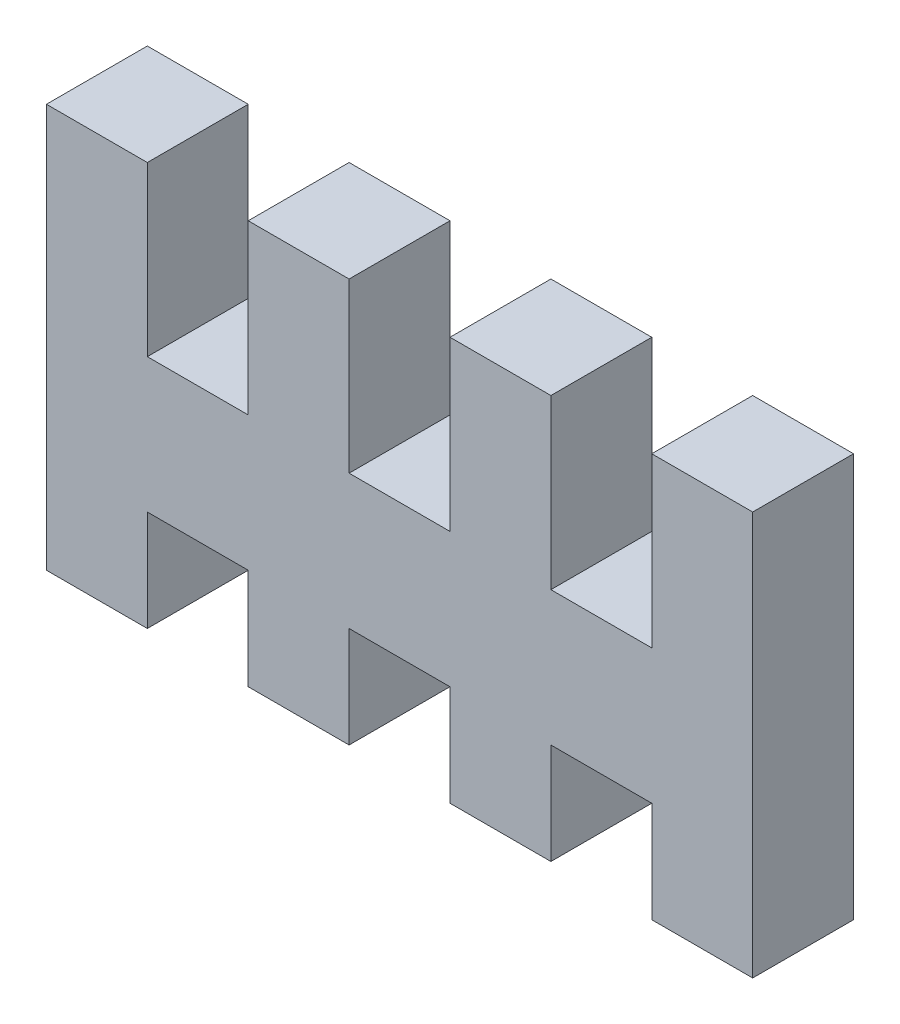
ISO-10303-21;
HEADER;
FILE_DESCRIPTION(('STEP AP214'),'2;1');
FILE_NAME('part.step','',(''),(''),'','','');
FILE_SCHEMA(('AUTOMOTIVE_DESIGN { 1 0 10303 214 1 1 1 1 }'));
ENDSEC;
DATA;
#1=APPLICATION_CONTEXT('core data for automotive mechanical design processes');
#2=APPLICATION_PROTOCOL_DEFINITION('international standard','automotive_design',2000,#1);
#3=PRODUCT_CONTEXT('',#1,'mechanical');
#4=PRODUCT('Part','Part','',(#3));
#5=PRODUCT_RELATED_PRODUCT_CATEGORY('part','',(#4));
#6=PRODUCT_DEFINITION_FORMATION('','',#4);
#7=PRODUCT_DEFINITION_CONTEXT('part definition',#1,'design');
#8=PRODUCT_DEFINITION('design','',#6,#7);
#9=PRODUCT_DEFINITION_SHAPE('','',#8);
#10=(LENGTH_UNIT() NAMED_UNIT(*) SI_UNIT(.MILLI.,.METRE.));
#11=(NAMED_UNIT(*) PLANE_ANGLE_UNIT() SI_UNIT($,.RADIAN.));
#12=(NAMED_UNIT(*) SI_UNIT($,.STERADIAN.) SOLID_ANGLE_UNIT());
#13=UNCERTAINTY_MEASURE_WITH_UNIT(LENGTH_MEASURE(1.E-05),#10,'distance_accuracy_value','');
#14=(GEOMETRIC_REPRESENTATION_CONTEXT(3) GLOBAL_UNCERTAINTY_ASSIGNED_CONTEXT((#13)) GLOBAL_UNIT_ASSIGNED_CONTEXT((#10,
#11,#12)) REPRESENTATION_CONTEXT('',''));
#15=CARTESIAN_POINT('',(0.,0.,0.));
#16=DIRECTION('',(0.,0.,1.));
#17=DIRECTION('',(1.,0.,0.));
#18=AXIS2_PLACEMENT_3D('',#15,#16,#17);
#19=CARTESIAN_POINT('',(0.,0.,3.));
#20=DIRECTION('',(0.,1.,0.));
#21=DIRECTION('',(0.,0.,1.));
#22=AXIS2_PLACEMENT_3D('',#19,#20,#21);
#23=PLANE('',#22);
#24=DIRECTION('',(1.,0.,0.));
#25=VECTOR('',#24,1.);
#26=CARTESIAN_POINT('',(0.,0.,0.));
#27=LINE('',#26,#25);
#28=CARTESIAN_POINT('',(3.,0.,0.));
#29=VERTEX_POINT('',#28);
#30=CARTESIAN_POINT('',(6.,0.,0.));
#31=VERTEX_POINT('',#30);
#32=EDGE_CURVE('E254',#29,#31,#27,.T.);
#33=ORIENTED_EDGE('',*,*,#32,.T.);
#34=DIRECTION('',(0.,0.,-1.));
#35=VECTOR('',#34,1.);
#36=CARTESIAN_POINT('',(6.,0.,3.));
#37=LINE('',#36,#35);
#38=CARTESIAN_POINT('',(6.,0.,3.));
#39=VERTEX_POINT('',#38);
#40=EDGE_CURVE('E11',#39,#31,#37,.T.);
#41=ORIENTED_EDGE('',*,*,#40,.F.);
#42=DIRECTION('',(1.,0.,0.));
#43=VECTOR('',#42,1.);
#44=CARTESIAN_POINT('',(0.,0.,3.));
#45=LINE('',#44,#43);
#46=CARTESIAN_POINT('',(3.,0.,3.));
#47=VERTEX_POINT('',#46);
#48=EDGE_CURVE('E322',#47,#39,#45,.T.);
#49=ORIENTED_EDGE('',*,*,#48,.F.);
#50=DIRECTION('',(0.,0.,-1.));
#51=VECTOR('',#50,1.);
#52=CARTESIAN_POINT('',(3.,0.,3.));
#53=LINE('',#52,#51);
#54=EDGE_CURVE('E52',#47,#29,#53,.T.);
#55=ORIENTED_EDGE('',*,*,#54,.T.);
#56=EDGE_LOOP('',(#33,#41,#49,#55));
#57=FACE_BOUND('',#56,.T.);
#58=ADVANCED_FACE('F35',(#57),#23,.F.);
#59=CARTESIAN_POINT('',(6.,0.,3.));
#60=DIRECTION('',(1.,0.,0.));
#61=DIRECTION('',(0.,0.,-1.));
#62=AXIS2_PLACEMENT_3D('',#59,#60,#61);
#63=PLANE('',#62);
#64=DIRECTION('',(0.,-1.,0.));
#65=VECTOR('',#64,1.);
#66=CARTESIAN_POINT('',(6.,0.,0.));
#67=LINE('',#66,#65);
#68=CARTESIAN_POINT('',(6.,-3.,0.));
#69=VERTEX_POINT('',#68);
#70=EDGE_CURVE('E256',#31,#69,#67,.T.);
#71=ORIENTED_EDGE('',*,*,#70,.T.);
#72=DIRECTION('',(0.,0.,-1.));
#73=VECTOR('',#72,1.);
#74=CARTESIAN_POINT('',(6.,-3.,3.));
#75=LINE('',#74,#73);
#76=CARTESIAN_POINT('',(6.,-3.,3.));
#77=VERTEX_POINT('',#76);
#78=EDGE_CURVE('E44',#77,#69,#75,.T.);
#79=ORIENTED_EDGE('',*,*,#78,.F.);
#80=DIRECTION('',(0.,-1.,0.));
#81=VECTOR('',#80,1.);
#82=CARTESIAN_POINT('',(6.,0.,3.));
#83=LINE('',#82,#81);
#84=EDGE_CURVE('E151',#39,#77,#83,.T.);
#85=ORIENTED_EDGE('',*,*,#84,.F.);
#86=ORIENTED_EDGE('',*,*,#40,.T.);
#87=EDGE_LOOP('',(#71,#79,#85,#86));
#88=FACE_BOUND('',#87,.T.);
#89=ADVANCED_FACE('F37',(#88),#63,.F.);
#90=CARTESIAN_POINT('',(0.,-3.,3.));
#91=DIRECTION('',(0.,1.,0.));
#92=DIRECTION('',(0.,0.,1.));
#93=AXIS2_PLACEMENT_3D('',#90,#91,#92);
#94=PLANE('',#93);
#95=DIRECTION('',(1.,0.,0.));
#96=VECTOR('',#95,1.);
#97=CARTESIAN_POINT('',(0.,-3.,0.));
#98=LINE('',#97,#96);
#99=CARTESIAN_POINT('',(9.,-3.,0.));
#100=VERTEX_POINT('',#99);
#101=EDGE_CURVE('E260',#69,#100,#98,.T.);
#102=ORIENTED_EDGE('',*,*,#101,.T.);
#103=DIRECTION('',(0.,0.,-1.));
#104=VECTOR('',#103,1.);
#105=CARTESIAN_POINT('',(9.,-3.,3.));
#106=LINE('',#105,#104);
#107=CARTESIAN_POINT('',(9.,-3.,3.));
#108=VERTEX_POINT('',#107);
#109=EDGE_CURVE('E373',#108,#100,#106,.T.);
#110=ORIENTED_EDGE('',*,*,#109,.F.);
#111=DIRECTION('',(1.,0.,0.));
#112=VECTOR('',#111,1.);
#113=CARTESIAN_POINT('',(0.,-3.,3.));
#114=LINE('',#113,#112);
#115=EDGE_CURVE('E380',#77,#108,#114,.T.);
#116=ORIENTED_EDGE('',*,*,#115,.F.);
#117=ORIENTED_EDGE('',*,*,#78,.T.);
#118=EDGE_LOOP('',(#102,#110,#116,#117));
#119=FACE_BOUND('',#118,.T.);
#120=ADVANCED_FACE('F378',(#119),#94,.F.);
#121=CARTESIAN_POINT('',(9.,0.,3.));
#122=DIRECTION('',(1.,0.,0.));
#123=DIRECTION('',(0.,0.,-1.));
#124=AXIS2_PLACEMENT_3D('',#121,#122,#123);
#125=PLANE('',#124);
#126=DIRECTION('',(0.,-1.,0.));
#127=VECTOR('',#126,1.);
#128=CARTESIAN_POINT('',(9.,0.,0.));
#129=LINE('',#128,#127);
#130=CARTESIAN_POINT('',(9.,0.,0.));
#131=VERTEX_POINT('',#130);
#132=EDGE_CURVE('E263',#131,#100,#129,.T.);
#133=ORIENTED_EDGE('',*,*,#132,.F.);
#134=DIRECTION('',(0.,0.,-1.));
#135=VECTOR('',#134,1.);
#136=CARTESIAN_POINT('',(9.,0.,3.));
#137=LINE('',#136,#135);
#138=CARTESIAN_POINT('',(9.,0.,3.));
#139=VERTEX_POINT('',#138);
#140=EDGE_CURVE('E371',#139,#131,#137,.T.);
#141=ORIENTED_EDGE('',*,*,#140,.F.);
#142=DIRECTION('',(0.,-1.,0.));
#143=VECTOR('',#142,1.);
#144=CARTESIAN_POINT('',(9.,0.,3.));
#145=LINE('',#144,#143);
#146=EDGE_CURVE('E391',#139,#108,#145,.T.);
#147=ORIENTED_EDGE('',*,*,#146,.T.);
#148=ORIENTED_EDGE('',*,*,#109,.T.);
#149=EDGE_LOOP('',(#133,#141,#147,#148));
#150=FACE_BOUND('',#149,.T.);
#151=ADVANCED_FACE('F387',(#150),#125,.T.);
#152=CARTESIAN_POINT('',(12.,0.,0.));
#153=VERTEX_POINT('',#152);
#154=EDGE_CURVE('E258',#131,#153,#27,.T.);
#155=ORIENTED_EDGE('',*,*,#154,.T.);
#156=DIRECTION('',(0.,0.,-1.));
#157=VECTOR('',#156,1.);
#158=CARTESIAN_POINT('',(12.,0.,3.));
#159=LINE('',#158,#157);
#160=CARTESIAN_POINT('',(12.,0.,3.));
#161=VERTEX_POINT('',#160);
#162=EDGE_CURVE('E368',#161,#153,#159,.T.);
#163=ORIENTED_EDGE('',*,*,#162,.F.);
#164=EDGE_CURVE('E392',#139,#161,#45,.T.);
#165=ORIENTED_EDGE('',*,*,#164,.F.);
#166=ORIENTED_EDGE('',*,*,#140,.T.);
#167=EDGE_LOOP('',(#155,#163,#165,#166));
#168=FACE_BOUND('',#167,.T.);
#169=ADVANCED_FACE('F484',(#168),#23,.F.);
#170=CARTESIAN_POINT('',(12.,0.,3.));
#171=DIRECTION('',(1.,0.,0.));
#172=DIRECTION('',(0.,0.,-1.));
#173=AXIS2_PLACEMENT_3D('',#170,#171,#172);
#174=PLANE('',#173);
#175=DIRECTION('',(0.,-1.,0.));
#176=VECTOR('',#175,1.);
#177=CARTESIAN_POINT('',(12.,0.,0.));
#178=LINE('',#177,#176);
#179=CARTESIAN_POINT('',(12.,-3.,0.));
#180=VERTEX_POINT('',#179);
#181=EDGE_CURVE('E266',#153,#180,#178,.T.);
#182=ORIENTED_EDGE('',*,*,#181,.T.);
#183=DIRECTION('',(0.,0.,-1.));
#184=VECTOR('',#183,1.);
#185=CARTESIAN_POINT('',(12.,-3.,3.));
#186=LINE('',#185,#184);
#187=CARTESIAN_POINT('',(12.,-3.,3.));
#188=VERTEX_POINT('',#187);
#189=EDGE_CURVE('E365',#188,#180,#186,.T.);
#190=ORIENTED_EDGE('',*,*,#189,.F.);
#191=DIRECTION('',(0.,-1.,0.));
#192=VECTOR('',#191,1.);
#193=CARTESIAN_POINT('',(12.,0.,3.));
#194=LINE('',#193,#192);
#195=EDGE_CURVE('E394',#161,#188,#194,.T.);
#196=ORIENTED_EDGE('',*,*,#195,.F.);
#197=ORIENTED_EDGE('',*,*,#162,.T.);
#198=EDGE_LOOP('',(#182,#190,#196,#197));
#199=FACE_BOUND('',#198,.T.);
#200=ADVANCED_FACE('F492',(#199),#174,.F.);
#201=CARTESIAN_POINT('',(0.,-3.,3.));
#202=DIRECTION('',(0.,1.,0.));
#203=DIRECTION('',(0.,0.,1.));
#204=AXIS2_PLACEMENT_3D('',#201,#202,#203);
#205=PLANE('',#204);
#206=DIRECTION('',(1.,0.,0.));
#207=VECTOR('',#206,1.);
#208=CARTESIAN_POINT('',(0.,-3.,0.));
#209=LINE('',#208,#207);
#210=CARTESIAN_POINT('',(15.,-3.,0.));
#211=VERTEX_POINT('',#210);
#212=EDGE_CURVE('E268',#180,#211,#209,.T.);
#213=ORIENTED_EDGE('',*,*,#212,.T.);
#214=DIRECTION('',(0.,0.,-1.));
#215=VECTOR('',#214,1.);
#216=CARTESIAN_POINT('',(15.,-3.,3.));
#217=LINE('',#216,#215);
#218=CARTESIAN_POINT('',(15.,-3.,3.));
#219=VERTEX_POINT('',#218);
#220=EDGE_CURVE('E363',#219,#211,#217,.T.);
#221=ORIENTED_EDGE('',*,*,#220,.F.);
#222=DIRECTION('',(1.,0.,0.));
#223=VECTOR('',#222,1.);
#224=CARTESIAN_POINT('',(0.,-3.,3.));
#225=LINE('',#224,#223);
#226=EDGE_CURVE('E401',#188,#219,#225,.T.);
#227=ORIENTED_EDGE('',*,*,#226,.F.);
#228=ORIENTED_EDGE('',*,*,#189,.T.);
#229=EDGE_LOOP('',(#213,#221,#227,#228));
#230=FACE_BOUND('',#229,.T.);
#231=ADVANCED_FACE('F504',(#230),#205,.F.);
#232=CARTESIAN_POINT('',(15.,0.,3.));
#233=DIRECTION('',(1.,0.,0.));
#234=DIRECTION('',(0.,1.,0.));
#235=AXIS2_PLACEMENT_3D('',#232,#233,#234);
#236=PLANE('',#235);
#237=DIRECTION('',(0.,-1.,0.));
#238=VECTOR('',#237,1.);
#239=CARTESIAN_POINT('',(15.,0.,0.));
#240=LINE('',#239,#238);
#241=CARTESIAN_POINT('',(15.,0.,0.));
#242=VERTEX_POINT('',#241);
#243=EDGE_CURVE('E271',#242,#211,#240,.T.);
#244=ORIENTED_EDGE('',*,*,#243,.F.);
#245=DIRECTION('',(0.,0.,-1.));
#246=VECTOR('',#245,1.);
#247=CARTESIAN_POINT('',(15.,0.,3.));
#248=LINE('',#247,#246);
#249=CARTESIAN_POINT('',(15.,0.,3.));
#250=VERTEX_POINT('',#249);
#251=EDGE_CURVE('E361',#250,#242,#248,.T.);
#252=ORIENTED_EDGE('',*,*,#251,.F.);
#253=DIRECTION('',(0.,-1.,0.));
#254=VECTOR('',#253,1.);
#255=CARTESIAN_POINT('',(15.,0.,3.));
#256=LINE('',#255,#254);
#257=EDGE_CURVE('E403',#250,#219,#256,.T.);
#258=ORIENTED_EDGE('',*,*,#257,.T.);
#259=ORIENTED_EDGE('',*,*,#220,.T.);
#260=EDGE_LOOP('',(#244,#252,#258,#259));
#261=FACE_BOUND('',#260,.T.);
#262=ADVANCED_FACE('F496',(#261),#236,.T.);
#263=CARTESIAN_POINT('',(18.,0.,0.));
#264=VERTEX_POINT('',#263);
#265=EDGE_CURVE('E257',#242,#264,#27,.T.);
#266=ORIENTED_EDGE('',*,*,#265,.T.);
#267=DIRECTION('',(0.,0.,-1.));
#268=VECTOR('',#267,1.);
#269=CARTESIAN_POINT('',(18.,0.,3.));
#270=LINE('',#269,#268);
#271=CARTESIAN_POINT('',(18.,0.,3.));
#272=VERTEX_POINT('',#271);
#273=EDGE_CURVE('E358',#272,#264,#270,.T.);
#274=ORIENTED_EDGE('',*,*,#273,.F.);
#275=EDGE_CURVE('E396',#250,#272,#45,.T.);
#276=ORIENTED_EDGE('',*,*,#275,.F.);
#277=ORIENTED_EDGE('',*,*,#251,.T.);
#278=EDGE_LOOP('',(#266,#274,#276,#277));
#279=FACE_BOUND('',#278,.T.);
#280=ADVANCED_FACE('F485',(#279),#23,.F.);
#281=CARTESIAN_POINT('',(18.,0.,3.));
#282=DIRECTION('',(1.,0.,0.));
#283=DIRECTION('',(0.,0.,-1.));
#284=AXIS2_PLACEMENT_3D('',#281,#282,#283);
#285=PLANE('',#284);
#286=DIRECTION('',(0.,-1.,0.));
#287=VECTOR('',#286,1.);
#288=CARTESIAN_POINT('',(18.,0.,0.));
#289=LINE('',#288,#287);
#290=CARTESIAN_POINT('',(18.,-3.,0.));
#291=VERTEX_POINT('',#290);
#292=EDGE_CURVE('E274',#264,#291,#289,.T.);
#293=ORIENTED_EDGE('',*,*,#292,.T.);
#294=DIRECTION('',(0.,0.,-1.));
#295=VECTOR('',#294,1.);
#296=CARTESIAN_POINT('',(18.,-3.,3.));
#297=LINE('',#296,#295);
#298=CARTESIAN_POINT('',(18.,-3.,3.));
#299=VERTEX_POINT('',#298);
#300=EDGE_CURVE('E355',#299,#291,#297,.T.);
#301=ORIENTED_EDGE('',*,*,#300,.F.);
#302=DIRECTION('',(0.,-1.,0.));
#303=VECTOR('',#302,1.);
#304=CARTESIAN_POINT('',(18.,0.,3.));
#305=LINE('',#304,#303);
#306=EDGE_CURVE('E406',#272,#299,#305,.T.);
#307=ORIENTED_EDGE('',*,*,#306,.F.);
#308=ORIENTED_EDGE('',*,*,#273,.T.);
#309=EDGE_LOOP('',(#293,#301,#307,#308));
#310=FACE_BOUND('',#309,.T.);
#311=ADVANCED_FACE('F495',(#310),#285,.F.);
#312=CARTESIAN_POINT('',(0.,-3.,3.));
#313=DIRECTION('',(0.,1.,0.));
#314=DIRECTION('',(0.,0.,1.));
#315=AXIS2_PLACEMENT_3D('',#312,#313,#314);
#316=PLANE('',#315);
#317=DIRECTION('',(1.,0.,0.));
#318=VECTOR('',#317,1.);
#319=CARTESIAN_POINT('',(0.,-3.,0.));
#320=LINE('',#319,#318);
#321=CARTESIAN_POINT('',(21.,-3.,0.));
#322=VERTEX_POINT('',#321);
#323=EDGE_CURVE('E276',#291,#322,#320,.T.);
#324=ORIENTED_EDGE('',*,*,#323,.T.);
#325=DIRECTION('',(0.,0.,-1.));
#326=VECTOR('',#325,1.);
#327=CARTESIAN_POINT('',(21.,-3.,3.));
#328=LINE('',#327,#326);
#329=CARTESIAN_POINT('',(21.,-3.,3.));
#330=VERTEX_POINT('',#329);
#331=EDGE_CURVE('E352',#330,#322,#328,.T.);
#332=ORIENTED_EDGE('',*,*,#331,.F.);
#333=DIRECTION('',(1.,0.,0.));
#334=VECTOR('',#333,1.);
#335=CARTESIAN_POINT('',(0.,-3.,3.));
#336=LINE('',#335,#334);
#337=EDGE_CURVE('E408',#299,#330,#336,.T.);
#338=ORIENTED_EDGE('',*,*,#337,.F.);
#339=ORIENTED_EDGE('',*,*,#300,.T.);
#340=EDGE_LOOP('',(#324,#332,#338,#339));
#341=FACE_BOUND('',#340,.T.);
#342=ADVANCED_FACE('F502',(#341),#316,.F.);
#343=CARTESIAN_POINT('',(21.,0.,3.));
#344=DIRECTION('',(-1.,0.,0.));
#345=DIRECTION('',(0.,0.,1.));
#346=AXIS2_PLACEMENT_3D('',#343,#344,#345);
#347=PLANE('',#346);
#348=DIRECTION('',(0.,1.,0.));
#349=VECTOR('',#348,1.);
#350=CARTESIAN_POINT('',(21.,0.,0.));
#351=LINE('',#350,#349);
#352=CARTESIAN_POINT('',(21.,9.,0.));
#353=VERTEX_POINT('',#352);
#354=EDGE_CURVE('E278',#322,#353,#351,.T.);
#355=ORIENTED_EDGE('',*,*,#354,.T.);
#356=DIRECTION('',(0.,0.,-1.));
#357=VECTOR('',#356,1.);
#358=CARTESIAN_POINT('',(21.,9.,3.));
#359=LINE('',#358,#357);
#360=CARTESIAN_POINT('',(21.,9.,3.));
#361=VERTEX_POINT('',#360);
#362=EDGE_CURVE('E350',#361,#353,#359,.T.);
#363=ORIENTED_EDGE('',*,*,#362,.F.);
#364=DIRECTION('',(0.,1.,0.));
#365=VECTOR('',#364,1.);
#366=CARTESIAN_POINT('',(21.,0.,3.));
#367=LINE('',#366,#365);
#368=EDGE_CURVE('E410',#330,#361,#367,.T.);
#369=ORIENTED_EDGE('',*,*,#368,.F.);
#370=ORIENTED_EDGE('',*,*,#331,.T.);
#371=EDGE_LOOP('',(#355,#363,#369,#370));
#372=FACE_BOUND('',#371,.T.);
#373=ADVANCED_FACE('F520',(#372),#347,.F.);
#374=CARTESIAN_POINT('',(0.,9.,3.));
#375=DIRECTION('',(0.,1.,0.));
#376=DIRECTION('',(0.,0.,1.));
#377=AXIS2_PLACEMENT_3D('',#374,#375,#376);
#378=PLANE('',#377);
#379=DIRECTION('',(1.,0.,0.));
#380=VECTOR('',#379,1.);
#381=CARTESIAN_POINT('',(0.,9.,0.));
#382=LINE('',#381,#380);
#383=CARTESIAN_POINT('',(18.,9.,0.));
#384=VERTEX_POINT('',#383);
#385=EDGE_CURVE('E281',#384,#353,#382,.T.);
#386=ORIENTED_EDGE('',*,*,#385,.F.);
#387=DIRECTION('',(0.,0.,-1.));
#388=VECTOR('',#387,1.);
#389=CARTESIAN_POINT('',(18.,9.,3.));
#390=LINE('',#389,#388);
#391=CARTESIAN_POINT('',(18.,9.,3.));
#392=VERTEX_POINT('',#391);
#393=EDGE_CURVE('E348',#392,#384,#390,.T.);
#394=ORIENTED_EDGE('',*,*,#393,.F.);
#395=DIRECTION('',(1.,0.,0.));
#396=VECTOR('',#395,1.);
#397=CARTESIAN_POINT('',(0.,9.,3.));
#398=LINE('',#397,#396);
#399=EDGE_CURVE('E412',#392,#361,#398,.T.);
#400=ORIENTED_EDGE('',*,*,#399,.T.);
#401=ORIENTED_EDGE('',*,*,#362,.T.);
#402=EDGE_LOOP('',(#386,#394,#400,#401));
#403=FACE_BOUND('',#402,.T.);
#404=ADVANCED_FACE('F720',(#403),#378,.T.);
#405=CARTESIAN_POINT('',(18.,0.,3.));
#406=DIRECTION('',(-1.,0.,0.));
#407=DIRECTION('',(0.,0.,1.));
#408=AXIS2_PLACEMENT_3D('',#405,#406,#407);
#409=PLANE('',#408);
#410=DIRECTION('',(0.,1.,0.));
#411=VECTOR('',#410,1.);
#412=CARTESIAN_POINT('',(18.,0.,0.));
#413=LINE('',#412,#411);
#414=CARTESIAN_POINT('',(18.,4.,0.));
#415=VERTEX_POINT('',#414);
#416=EDGE_CURVE('E284',#415,#384,#413,.T.);
#417=ORIENTED_EDGE('',*,*,#416,.F.);
#418=DIRECTION('',(0.,0.,-1.));
#419=VECTOR('',#418,1.);
#420=CARTESIAN_POINT('',(18.,4.,3.));
#421=LINE('',#420,#419);
#422=CARTESIAN_POINT('',(18.,4.,3.));
#423=VERTEX_POINT('',#422);
#424=EDGE_CURVE('E346',#423,#415,#421,.T.);
#425=ORIENTED_EDGE('',*,*,#424,.F.);
#426=DIRECTION('',(0.,1.,0.));
#427=VECTOR('',#426,1.);
#428=CARTESIAN_POINT('',(18.,0.,3.));
#429=LINE('',#428,#427);
#430=EDGE_CURVE('E415',#423,#392,#429,.T.);
#431=ORIENTED_EDGE('',*,*,#430,.T.);
#432=ORIENTED_EDGE('',*,*,#393,.T.);
#433=EDGE_LOOP('',(#417,#425,#431,#432));
#434=FACE_BOUND('',#433,.T.);
#435=ADVANCED_FACE('F710',(#434),#409,.T.);
#436=CARTESIAN_POINT('',(0.,4.,3.));
#437=DIRECTION('',(0.,1.,0.));
#438=DIRECTION('',(0.,0.,1.));
#439=AXIS2_PLACEMENT_3D('',#436,#437,#438);
#440=PLANE('',#439);
#441=DIRECTION('',(1.,0.,0.));
#442=VECTOR('',#441,1.);
#443=CARTESIAN_POINT('',(0.,4.,0.));
#444=LINE('',#443,#442);
#445=CARTESIAN_POINT('',(15.,4.,0.));
#446=VERTEX_POINT('',#445);
#447=EDGE_CURVE('E287',#446,#415,#444,.T.);
#448=ORIENTED_EDGE('',*,*,#447,.F.);
#449=DIRECTION('',(0.,0.,-1.));
#450=VECTOR('',#449,1.);
#451=CARTESIAN_POINT('',(15.,4.,3.));
#452=LINE('',#451,#450);
#453=CARTESIAN_POINT('',(15.,4.,3.));
#454=VERTEX_POINT('',#453);
#455=EDGE_CURVE('E344',#454,#446,#452,.T.);
#456=ORIENTED_EDGE('',*,*,#455,.F.);
#457=DIRECTION('',(1.,0.,0.));
#458=VECTOR('',#457,1.);
#459=CARTESIAN_POINT('',(0.,4.,3.));
#460=LINE('',#459,#458);
#461=EDGE_CURVE('E418',#454,#423,#460,.T.);
#462=ORIENTED_EDGE('',*,*,#461,.T.);
#463=ORIENTED_EDGE('',*,*,#424,.T.);
#464=EDGE_LOOP('',(#448,#456,#462,#463));
#465=FACE_BOUND('',#464,.T.);
#466=ADVANCED_FACE('F480',(#465),#440,.T.);
#467=CARTESIAN_POINT('',(15.,0.,3.));
#468=DIRECTION('',(-1.,0.,0.));
#469=DIRECTION('',(0.,0.,1.));
#470=AXIS2_PLACEMENT_3D('',#467,#468,#469);
#471=PLANE('',#470);
#472=DIRECTION('',(0.,1.,0.));
#473=VECTOR('',#472,1.);
#474=CARTESIAN_POINT('',(15.,0.,0.));
#475=LINE('',#474,#473);
#476=CARTESIAN_POINT('',(15.,9.,0.));
#477=VERTEX_POINT('',#476);
#478=EDGE_CURVE('E290',#446,#477,#475,.T.);
#479=ORIENTED_EDGE('',*,*,#478,.T.);
#480=DIRECTION('',(0.,0.,-1.));
#481=VECTOR('',#480,1.);
#482=CARTESIAN_POINT('',(15.,9.,3.));
#483=LINE('',#482,#481);
#484=CARTESIAN_POINT('',(15.,9.,3.));
#485=VERTEX_POINT('',#484);
#486=EDGE_CURVE('E342',#485,#477,#483,.T.);
#487=ORIENTED_EDGE('',*,*,#486,.F.);
#488=DIRECTION('',(0.,1.,0.));
#489=VECTOR('',#488,1.);
#490=CARTESIAN_POINT('',(15.,0.,3.));
#491=LINE('',#490,#489);
#492=EDGE_CURVE('E421',#454,#485,#491,.T.);
#493=ORIENTED_EDGE('',*,*,#492,.F.);
#494=ORIENTED_EDGE('',*,*,#455,.T.);
#495=EDGE_LOOP('',(#479,#487,#493,#494));
#496=FACE_BOUND('',#495,.T.);
#497=ADVANCED_FACE('F691',(#496),#471,.F.);
#498=CARTESIAN_POINT('',(0.,9.,3.));
#499=DIRECTION('',(0.,1.,0.));
#500=DIRECTION('',(0.,0.,1.));
#501=AXIS2_PLACEMENT_3D('',#498,#499,#500);
#502=PLANE('',#501);
#503=DIRECTION('',(1.,0.,0.));
#504=VECTOR('',#503,1.);
#505=CARTESIAN_POINT('',(0.,9.,0.));
#506=LINE('',#505,#504);
#507=CARTESIAN_POINT('',(12.,9.,0.));
#508=VERTEX_POINT('',#507);
#509=EDGE_CURVE('E295',#508,#477,#506,.T.);
#510=ORIENTED_EDGE('',*,*,#509,.F.);
#511=DIRECTION('',(0.,0.,-1.));
#512=VECTOR('',#511,1.);
#513=CARTESIAN_POINT('',(12.,9.,3.));
#514=LINE('',#513,#512);
#515=CARTESIAN_POINT('',(12.,9.,3.));
#516=VERTEX_POINT('',#515);
#517=EDGE_CURVE('E340',#516,#508,#514,.T.);
#518=ORIENTED_EDGE('',*,*,#517,.F.);
#519=DIRECTION('',(1.,0.,0.));
#520=VECTOR('',#519,1.);
#521=CARTESIAN_POINT('',(0.,9.,3.));
#522=LINE('',#521,#520);
#523=EDGE_CURVE('E425',#516,#485,#522,.T.);
#524=ORIENTED_EDGE('',*,*,#523,.T.);
#525=ORIENTED_EDGE('',*,*,#486,.T.);
#526=EDGE_LOOP('',(#510,#518,#524,#525));
#527=FACE_BOUND('',#526,.T.);
#528=ADVANCED_FACE('F683',(#527),#502,.T.);
#529=CARTESIAN_POINT('',(12.,0.,3.));
#530=DIRECTION('',(-1.,0.,0.));
#531=DIRECTION('',(0.,0.,1.));
#532=AXIS2_PLACEMENT_3D('',#529,#530,#531);
#533=PLANE('',#532);
#534=DIRECTION('',(0.,1.,0.));
#535=VECTOR('',#534,1.);
#536=CARTESIAN_POINT('',(12.,0.,0.));
#537=LINE('',#536,#535);
#538=CARTESIAN_POINT('',(12.,4.,0.));
#539=VERTEX_POINT('',#538);
#540=EDGE_CURVE('E298',#539,#508,#537,.T.);
#541=ORIENTED_EDGE('',*,*,#540,.F.);
#542=DIRECTION('',(0.,0.,-1.));
#543=VECTOR('',#542,1.);
#544=CARTESIAN_POINT('',(12.,4.,3.));
#545=LINE('',#544,#543);
#546=CARTESIAN_POINT('',(12.,4.,3.));
#547=VERTEX_POINT('',#546);
#548=EDGE_CURVE('E338',#547,#539,#545,.T.);
#549=ORIENTED_EDGE('',*,*,#548,.F.);
#550=DIRECTION('',(0.,1.,0.));
#551=VECTOR('',#550,1.);
#552=CARTESIAN_POINT('',(12.,0.,3.));
#553=LINE('',#552,#551);
#554=EDGE_CURVE('E428',#547,#516,#553,.T.);
#555=ORIENTED_EDGE('',*,*,#554,.T.);
#556=ORIENTED_EDGE('',*,*,#517,.T.);
#557=EDGE_LOOP('',(#541,#549,#555,#556));
#558=FACE_BOUND('',#557,.T.);
#559=ADVANCED_FACE('F455',(#558),#533,.T.);
#560=CARTESIAN_POINT('',(9.,4.,0.));
#561=VERTEX_POINT('',#560);
#562=EDGE_CURVE('E292',#561,#539,#444,.T.);
#563=ORIENTED_EDGE('',*,*,#562,.F.);
#564=DIRECTION('',(0.,0.,-1.));
#565=VECTOR('',#564,1.);
#566=CARTESIAN_POINT('',(9.,4.,3.));
#567=LINE('',#566,#565);
#568=CARTESIAN_POINT('',(9.,4.,3.));
#569=VERTEX_POINT('',#568);
#570=EDGE_CURVE('E336',#569,#561,#567,.T.);
#571=ORIENTED_EDGE('',*,*,#570,.F.);
#572=EDGE_CURVE('E423',#569,#547,#460,.T.);
#573=ORIENTED_EDGE('',*,*,#572,.T.);
#574=ORIENTED_EDGE('',*,*,#548,.T.);
#575=EDGE_LOOP('',(#563,#571,#573,#574));
#576=FACE_BOUND('',#575,.T.);
#577=ADVANCED_FACE('F447',(#576),#440,.T.);
#578=CARTESIAN_POINT('',(9.,0.,3.));
#579=DIRECTION('',(-1.,0.,0.));
#580=DIRECTION('',(0.,0.,1.));
#581=AXIS2_PLACEMENT_3D('',#578,#579,#580);
#582=PLANE('',#581);
#583=DIRECTION('',(0.,1.,0.));
#584=VECTOR('',#583,1.);
#585=CARTESIAN_POINT('',(9.,0.,0.));
#586=LINE('',#585,#584);
#587=CARTESIAN_POINT('',(9.,9.,0.));
#588=VERTEX_POINT('',#587);
#589=EDGE_CURVE('E301',#561,#588,#586,.T.);
#590=ORIENTED_EDGE('',*,*,#589,.T.);
#591=DIRECTION('',(0.,0.,-1.));
#592=VECTOR('',#591,1.);
#593=CARTESIAN_POINT('',(9.,9.,3.));
#594=LINE('',#593,#592);
#595=CARTESIAN_POINT('',(9.,9.,3.));
#596=VERTEX_POINT('',#595);
#597=EDGE_CURVE('E334',#596,#588,#594,.T.);
#598=ORIENTED_EDGE('',*,*,#597,.F.);
#599=DIRECTION('',(0.,1.,0.));
#600=VECTOR('',#599,1.);
#601=CARTESIAN_POINT('',(9.,0.,3.));
#602=LINE('',#601,#600);
#603=EDGE_CURVE('E431',#569,#596,#602,.T.);
#604=ORIENTED_EDGE('',*,*,#603,.F.);
#605=ORIENTED_EDGE('',*,*,#570,.T.);
#606=EDGE_LOOP('',(#590,#598,#604,#605));
#607=FACE_BOUND('',#606,.T.);
#608=ADVANCED_FACE('F471',(#607),#582,.F.);
#609=CARTESIAN_POINT('',(0.,9.,3.));
#610=DIRECTION('',(0.,1.,0.));
#611=DIRECTION('',(0.,0.,1.));
#612=AXIS2_PLACEMENT_3D('',#609,#610,#611);
#613=PLANE('',#612);
#614=DIRECTION('',(1.,0.,0.));
#615=VECTOR('',#614,1.);
#616=CARTESIAN_POINT('',(0.,9.,0.));
#617=LINE('',#616,#615);
#618=CARTESIAN_POINT('',(6.,9.,0.));
#619=VERTEX_POINT('',#618);
#620=EDGE_CURVE('E304',#619,#588,#617,.T.);
#621=ORIENTED_EDGE('',*,*,#620,.F.);
#622=DIRECTION('',(0.,0.,-1.));
#623=VECTOR('',#622,1.);
#624=CARTESIAN_POINT('',(6.,9.,3.));
#625=LINE('',#624,#623);
#626=CARTESIAN_POINT('',(6.,9.,3.));
#627=VERTEX_POINT('',#626);
#628=EDGE_CURVE('E332',#627,#619,#625,.T.);
#629=ORIENTED_EDGE('',*,*,#628,.F.);
#630=DIRECTION('',(1.,0.,0.));
#631=VECTOR('',#630,1.);
#632=CARTESIAN_POINT('',(0.,9.,3.));
#633=LINE('',#632,#631);
#634=EDGE_CURVE('E433',#627,#596,#633,.T.);
#635=ORIENTED_EDGE('',*,*,#634,.T.);
#636=ORIENTED_EDGE('',*,*,#597,.T.);
#637=EDGE_LOOP('',(#621,#629,#635,#636));
#638=FACE_BOUND('',#637,.T.);
#639=ADVANCED_FACE('F469',(#638),#613,.T.);
#640=CARTESIAN_POINT('',(6.,0.,3.));
#641=DIRECTION('',(-1.,0.,0.));
#642=DIRECTION('',(0.,0.,1.));
#643=AXIS2_PLACEMENT_3D('',#640,#641,#642);
#644=PLANE('',#643);
#645=DIRECTION('',(0.,1.,0.));
#646=VECTOR('',#645,1.);
#647=CARTESIAN_POINT('',(6.,0.,0.));
#648=LINE('',#647,#646);
#649=CARTESIAN_POINT('',(6.,4.,0.));
#650=VERTEX_POINT('',#649);
#651=EDGE_CURVE('E307',#650,#619,#648,.T.);
#652=ORIENTED_EDGE('',*,*,#651,.F.);
#653=DIRECTION('',(0.,0.,-1.));
#654=VECTOR('',#653,1.);
#655=CARTESIAN_POINT('',(6.,4.,3.));
#656=LINE('',#655,#654);
#657=CARTESIAN_POINT('',(6.,4.,3.));
#658=VERTEX_POINT('',#657);
#659=EDGE_CURVE('E330',#658,#650,#656,.T.);
#660=ORIENTED_EDGE('',*,*,#659,.F.);
#661=DIRECTION('',(0.,1.,0.));
#662=VECTOR('',#661,1.);
#663=CARTESIAN_POINT('',(6.,0.,3.));
#664=LINE('',#663,#662);
#665=EDGE_CURVE('E436',#658,#627,#664,.T.);
#666=ORIENTED_EDGE('',*,*,#665,.T.);
#667=ORIENTED_EDGE('',*,*,#628,.T.);
#668=EDGE_LOOP('',(#652,#660,#666,#667));
#669=FACE_BOUND('',#668,.T.);
#670=ADVANCED_FACE('F466',(#669),#644,.T.);
#671=CARTESIAN_POINT('',(3.,4.,0.));
#672=VERTEX_POINT('',#671);
#673=EDGE_CURVE('E291',#672,#650,#444,.T.);
#674=ORIENTED_EDGE('',*,*,#673,.F.);
#675=DIRECTION('',(0.,0.,-1.));
#676=VECTOR('',#675,1.);
#677=CARTESIAN_POINT('',(3.,4.,3.));
#678=LINE('',#677,#676);
#679=CARTESIAN_POINT('',(3.,4.,3.));
#680=VERTEX_POINT('',#679);
#681=EDGE_CURVE('E328',#680,#672,#678,.T.);
#682=ORIENTED_EDGE('',*,*,#681,.F.);
#683=EDGE_CURVE('E422',#680,#658,#460,.T.);
#684=ORIENTED_EDGE('',*,*,#683,.T.);
#685=ORIENTED_EDGE('',*,*,#659,.T.);
#686=EDGE_LOOP('',(#674,#682,#684,#685));
#687=FACE_BOUND('',#686,.T.);
#688=ADVANCED_FACE('F463',(#687),#440,.T.);
#689=CARTESIAN_POINT('',(3.,0.,3.));
#690=DIRECTION('',(-1.,0.,0.));
#691=DIRECTION('',(0.,0.,1.));
#692=AXIS2_PLACEMENT_3D('',#689,#690,#691);
#693=PLANE('',#692);
#694=DIRECTION('',(0.,1.,0.));
#695=VECTOR('',#694,1.);
#696=CARTESIAN_POINT('',(3.,0.,0.));
#697=LINE('',#696,#695);
#698=CARTESIAN_POINT('',(3.,9.,0.));
#699=VERTEX_POINT('',#698);
#700=EDGE_CURVE('E310',#672,#699,#697,.T.);
#701=ORIENTED_EDGE('',*,*,#700,.T.);
#702=DIRECTION('',(0.,0.,-1.));
#703=VECTOR('',#702,1.);
#704=CARTESIAN_POINT('',(3.,9.,3.));
#705=LINE('',#704,#703);
#706=CARTESIAN_POINT('',(3.,9.,3.));
#707=VERTEX_POINT('',#706);
#708=EDGE_CURVE('E326',#707,#699,#705,.T.);
#709=ORIENTED_EDGE('',*,*,#708,.F.);
#710=DIRECTION('',(0.,1.,0.));
#711=VECTOR('',#710,1.);
#712=CARTESIAN_POINT('',(3.,0.,3.));
#713=LINE('',#712,#711);
#714=EDGE_CURVE('E249',#680,#707,#713,.T.);
#715=ORIENTED_EDGE('',*,*,#714,.F.);
#716=ORIENTED_EDGE('',*,*,#681,.T.);
#717=EDGE_LOOP('',(#701,#709,#715,#716));
#718=FACE_BOUND('',#717,.T.);
#719=ADVANCED_FACE('F542',(#718),#693,.F.);
#720=CARTESIAN_POINT('',(0.,9.,3.));
#721=DIRECTION('',(0.,1.,0.));
#722=DIRECTION('',(0.,0.,1.));
#723=AXIS2_PLACEMENT_3D('',#720,#721,#722);
#724=PLANE('',#723);
#725=DIRECTION('',(1.,0.,0.));
#726=VECTOR('',#725,1.);
#727=CARTESIAN_POINT('',(0.,9.,0.));
#728=LINE('',#727,#726);
#729=CARTESIAN_POINT('',(0.,9.,0.));
#730=VERTEX_POINT('',#729);
#731=EDGE_CURVE('E313',#730,#699,#728,.T.);
#732=ORIENTED_EDGE('',*,*,#731,.F.);
#733=DIRECTION('',(0.,0.,-1.));
#734=VECTOR('',#733,1.);
#735=CARTESIAN_POINT('',(0.,9.,3.));
#736=LINE('',#735,#734);
#737=CARTESIAN_POINT('',(0.,9.,3.));
#738=VERTEX_POINT('',#737);
#739=EDGE_CURVE('E236',#738,#730,#736,.T.);
#740=ORIENTED_EDGE('',*,*,#739,.F.);
#741=DIRECTION('',(1.,0.,0.));
#742=VECTOR('',#741,1.);
#743=CARTESIAN_POINT('',(0.,9.,3.));
#744=LINE('',#743,#742);
#745=EDGE_CURVE('E247',#738,#707,#744,.T.);
#746=ORIENTED_EDGE('',*,*,#745,.T.);
#747=ORIENTED_EDGE('',*,*,#708,.T.);
#748=EDGE_LOOP('',(#732,#740,#746,#747));
#749=FACE_BOUND('',#748,.T.);
#750=ADVANCED_FACE('F539',(#749),#724,.T.);
#751=CARTESIAN_POINT('',(0.,0.,3.));
#752=DIRECTION('',(-1.,0.,0.));
#753=DIRECTION('',(0.,0.,1.));
#754=AXIS2_PLACEMENT_3D('',#751,#752,#753);
#755=PLANE('',#754);
#756=DIRECTION('',(0.,1.,0.));
#757=VECTOR('',#756,1.);
#758=CARTESIAN_POINT('',(0.,0.,0.));
#759=LINE('',#758,#757);
#760=CARTESIAN_POINT('',(0.,-3.,0.));
#761=VERTEX_POINT('',#760);
#762=EDGE_CURVE('E233',#761,#730,#759,.T.);
#763=ORIENTED_EDGE('',*,*,#762,.F.);
#764=DIRECTION('',(0.,0.,-1.));
#765=VECTOR('',#764,1.);
#766=CARTESIAN_POINT('',(0.,-3.,3.));
#767=LINE('',#766,#765);
#768=CARTESIAN_POINT('',(0.,-3.,3.));
#769=VERTEX_POINT('',#768);
#770=EDGE_CURVE('E227',#769,#761,#767,.T.);
#771=ORIENTED_EDGE('',*,*,#770,.F.);
#772=DIRECTION('',(0.,1.,0.));
#773=VECTOR('',#772,1.);
#774=CARTESIAN_POINT('',(0.,0.,3.));
#775=LINE('',#774,#773);
#776=EDGE_CURVE('E231',#769,#738,#775,.T.);
#777=ORIENTED_EDGE('',*,*,#776,.T.);
#778=ORIENTED_EDGE('',*,*,#739,.T.);
#779=EDGE_LOOP('',(#763,#771,#777,#778));
#780=FACE_BOUND('',#779,.T.);
#781=ADVANCED_FACE('F229',(#780),#755,.T.);
#782=CARTESIAN_POINT('',(0.,-3.,3.));
#783=DIRECTION('',(0.,1.,0.));
#784=DIRECTION('',(0.,0.,1.));
#785=AXIS2_PLACEMENT_3D('',#782,#783,#784);
#786=PLANE('',#785);
#787=DIRECTION('',(1.,0.,0.));
#788=VECTOR('',#787,1.);
#789=CARTESIAN_POINT('',(0.,-3.,0.));
#790=LINE('',#789,#788);
#791=CARTESIAN_POINT('',(3.,-3.,0.));
#792=VERTEX_POINT('',#791);
#793=EDGE_CURVE('E317',#761,#792,#790,.T.);
#794=ORIENTED_EDGE('',*,*,#793,.T.);
#795=DIRECTION('',(0.,0.,-1.));
#796=VECTOR('',#795,1.);
#797=CARTESIAN_POINT('',(3.,-3.,3.));
#798=LINE('',#797,#796);
#799=CARTESIAN_POINT('',(3.,-3.,3.));
#800=VERTEX_POINT('',#799);
#801=EDGE_CURVE('E139',#800,#792,#798,.T.);
#802=ORIENTED_EDGE('',*,*,#801,.F.);
#803=DIRECTION('',(1.,0.,0.));
#804=VECTOR('',#803,1.);
#805=CARTESIAN_POINT('',(0.,-3.,3.));
#806=LINE('',#805,#804);
#807=EDGE_CURVE('E238',#769,#800,#806,.T.);
#808=ORIENTED_EDGE('',*,*,#807,.F.);
#809=ORIENTED_EDGE('',*,*,#770,.T.);
#810=EDGE_LOOP('',(#794,#802,#808,#809));
#811=FACE_BOUND('',#810,.T.);
#812=ADVANCED_FACE('F239',(#811),#786,.F.);
#813=CARTESIAN_POINT('',(3.,0.,3.));
#814=DIRECTION('',(1.,0.,0.));
#815=DIRECTION('',(0.,1.,0.));
#816=AXIS2_PLACEMENT_3D('',#813,#814,#815);
#817=PLANE('',#816);
#818=DIRECTION('',(0.,-1.,0.));
#819=VECTOR('',#818,1.);
#820=CARTESIAN_POINT('',(3.,0.,0.));
#821=LINE('',#820,#819);
#822=EDGE_CURVE('E319',#29,#792,#821,.T.);
#823=ORIENTED_EDGE('',*,*,#822,.F.);
#824=ORIENTED_EDGE('',*,*,#54,.F.);
#825=DIRECTION('',(0.,-1.,0.));
#826=VECTOR('',#825,1.);
#827=CARTESIAN_POINT('',(3.,0.,3.));
#828=LINE('',#827,#826);
#829=EDGE_CURVE('E242',#47,#800,#828,.T.);
#830=ORIENTED_EDGE('',*,*,#829,.T.);
#831=ORIENTED_EDGE('',*,*,#801,.T.);
#832=EDGE_LOOP('',(#823,#824,#830,#831));
#833=FACE_BOUND('',#832,.T.);
#834=ADVANCED_FACE('F526',(#833),#817,.T.);
#835=CARTESIAN_POINT('',(0.,0.,3.));
#836=DIRECTION('',(0.,0.,1.));
#837=DIRECTION('',(1.,0.,0.));
#838=AXIS2_PLACEMENT_3D('',#835,#836,#837);
#839=PLANE('',#838);
#840=ORIENTED_EDGE('',*,*,#48,.T.);
#841=ORIENTED_EDGE('',*,*,#84,.T.);
#842=ORIENTED_EDGE('',*,*,#115,.T.);
#843=ORIENTED_EDGE('',*,*,#146,.F.);
#844=ORIENTED_EDGE('',*,*,#164,.T.);
#845=ORIENTED_EDGE('',*,*,#195,.T.);
#846=ORIENTED_EDGE('',*,*,#226,.T.);
#847=ORIENTED_EDGE('',*,*,#257,.F.);
#848=ORIENTED_EDGE('',*,*,#275,.T.);
#849=ORIENTED_EDGE('',*,*,#306,.T.);
#850=ORIENTED_EDGE('',*,*,#337,.T.);
#851=ORIENTED_EDGE('',*,*,#368,.T.);
#852=ORIENTED_EDGE('',*,*,#399,.F.);
#853=ORIENTED_EDGE('',*,*,#430,.F.);
#854=ORIENTED_EDGE('',*,*,#461,.F.);
#855=ORIENTED_EDGE('',*,*,#492,.T.);
#856=ORIENTED_EDGE('',*,*,#523,.F.);
#857=ORIENTED_EDGE('',*,*,#554,.F.);
#858=ORIENTED_EDGE('',*,*,#572,.F.);
#859=ORIENTED_EDGE('',*,*,#603,.T.);
#860=ORIENTED_EDGE('',*,*,#634,.F.);
#861=ORIENTED_EDGE('',*,*,#665,.F.);
#862=ORIENTED_EDGE('',*,*,#683,.F.);
#863=ORIENTED_EDGE('',*,*,#714,.T.);
#864=ORIENTED_EDGE('',*,*,#745,.F.);
#865=ORIENTED_EDGE('',*,*,#776,.F.);
#866=ORIENTED_EDGE('',*,*,#807,.T.);
#867=ORIENTED_EDGE('',*,*,#829,.F.);
#868=EDGE_LOOP('',(#840,#841,#842,#843,#844,#845,#846,#847,#848,#849,#850,#851,#852,#853,#854,
#855,#856,#857,#858,#859,#860,#861,#862,#863,#864,#865,#866,#867));
#869=FACE_BOUND('',#868,.T.);
#870=ADVANCED_FACE('F245',(#869),#839,.T.);
#871=CARTESIAN_POINT('',(0.,0.,0.));
#872=DIRECTION('',(0.,0.,1.));
#873=DIRECTION('',(1.,0.,0.));
#874=AXIS2_PLACEMENT_3D('',#871,#872,#873);
#875=PLANE('',#874);
#876=ORIENTED_EDGE('',*,*,#32,.F.);
#877=ORIENTED_EDGE('',*,*,#822,.T.);
#878=ORIENTED_EDGE('',*,*,#793,.F.);
#879=ORIENTED_EDGE('',*,*,#762,.T.);
#880=ORIENTED_EDGE('',*,*,#731,.T.);
#881=ORIENTED_EDGE('',*,*,#700,.F.);
#882=ORIENTED_EDGE('',*,*,#673,.T.);
#883=ORIENTED_EDGE('',*,*,#651,.T.);
#884=ORIENTED_EDGE('',*,*,#620,.T.);
#885=ORIENTED_EDGE('',*,*,#589,.F.);
#886=ORIENTED_EDGE('',*,*,#562,.T.);
#887=ORIENTED_EDGE('',*,*,#540,.T.);
#888=ORIENTED_EDGE('',*,*,#509,.T.);
#889=ORIENTED_EDGE('',*,*,#478,.F.);
#890=ORIENTED_EDGE('',*,*,#447,.T.);
#891=ORIENTED_EDGE('',*,*,#416,.T.);
#892=ORIENTED_EDGE('',*,*,#385,.T.);
#893=ORIENTED_EDGE('',*,*,#354,.F.);
#894=ORIENTED_EDGE('',*,*,#323,.F.);
#895=ORIENTED_EDGE('',*,*,#292,.F.);
#896=ORIENTED_EDGE('',*,*,#265,.F.);
#897=ORIENTED_EDGE('',*,*,#243,.T.);
#898=ORIENTED_EDGE('',*,*,#212,.F.);
#899=ORIENTED_EDGE('',*,*,#181,.F.);
#900=ORIENTED_EDGE('',*,*,#154,.F.);
#901=ORIENTED_EDGE('',*,*,#132,.T.);
#902=ORIENTED_EDGE('',*,*,#101,.F.);
#903=ORIENTED_EDGE('',*,*,#70,.F.);
#904=EDGE_LOOP('',(#876,#877,#878,#879,#880,#881,#882,#883,#884,#885,#886,#887,#888,#889,#890,
#891,#892,#893,#894,#895,#896,#897,#898,#899,#900,#901,#902,#903));
#905=FACE_BOUND('',#904,.T.);
#906=ADVANCED_FACE('F382',(#905),#875,.F.);
#907=CLOSED_SHELL('',(#58,#89,#120,#151,#169,#200,#231,#262,#280,#311,#342,#373,#404,#435,#466,
#497,#528,#559,#577,#608,#639,#670,#688,#719,#750,#781,#812,#834,#870,#906));
#908=MANIFOLD_SOLID_BREP('B2',#907);
#909=ADVANCED_BREP_SHAPE_REPRESENTATION('',(#18,#908),#14);
#910=SHAPE_DEFINITION_REPRESENTATION(#9,#909);
ENDSEC;
END-ISO-10303-21;
